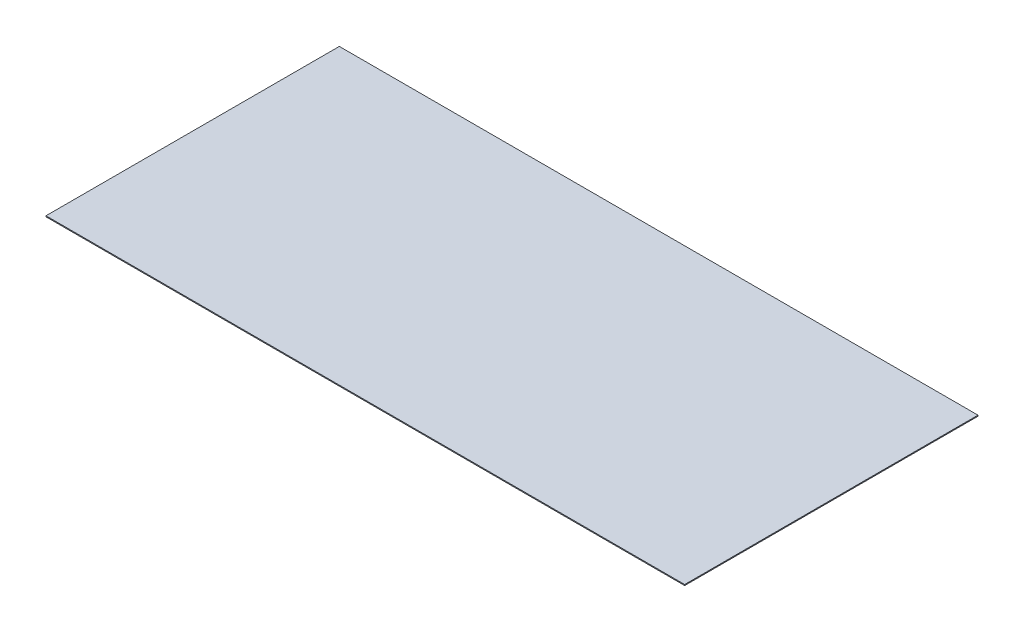
ISO-10303-21;
HEADER;
FILE_DESCRIPTION(('STEP AP214'),'2;1');
FILE_NAME('part.step','',(''),(''),'','','');
FILE_SCHEMA(('AUTOMOTIVE_DESIGN { 1 0 10303 214 1 1 1 1 }'));
ENDSEC;
DATA;
#1=APPLICATION_CONTEXT('core data for automotive mechanical design processes');
#2=APPLICATION_PROTOCOL_DEFINITION('international standard','automotive_design',2000,#1);
#3=PRODUCT_CONTEXT('',#1,'mechanical');
#4=PRODUCT('Part','Part','',(#3));
#5=PRODUCT_RELATED_PRODUCT_CATEGORY('part','',(#4));
#6=PRODUCT_DEFINITION_FORMATION('','',#4);
#7=PRODUCT_DEFINITION_CONTEXT('part definition',#1,'design');
#8=PRODUCT_DEFINITION('design','',#6,#7);
#9=PRODUCT_DEFINITION_SHAPE('','',#8);
#10=(LENGTH_UNIT() NAMED_UNIT(*) SI_UNIT(.MILLI.,.METRE.));
#11=(NAMED_UNIT(*) PLANE_ANGLE_UNIT() SI_UNIT($,.RADIAN.));
#12=(NAMED_UNIT(*) SI_UNIT($,.STERADIAN.) SOLID_ANGLE_UNIT());
#13=UNCERTAINTY_MEASURE_WITH_UNIT(LENGTH_MEASURE(1.E-05),#10,'distance_accuracy_value','');
#14=(GEOMETRIC_REPRESENTATION_CONTEXT(3) GLOBAL_UNCERTAINTY_ASSIGNED_CONTEXT((#13)) GLOBAL_UNIT_ASSIGNED_CONTEXT((#10,
#11,#12)) REPRESENTATION_CONTEXT('',''));
#15=CARTESIAN_POINT('',(0.,0.,0.));
#16=DIRECTION('',(0.,0.,1.));
#17=DIRECTION('',(1.,0.,0.));
#18=AXIS2_PLACEMENT_3D('',#15,#16,#17);
#19=CARTESIAN_POINT('',(337.5,1.,-155.));
#20=DIRECTION('',(-1.,0.,0.));
#21=DIRECTION('',(0.,0.,1.));
#22=AXIS2_PLACEMENT_3D('',#19,#20,#21);
#23=PLANE('',#22);
#24=DIRECTION('',(0.,0.,-1.));
#25=VECTOR('',#24,1.);
#26=CARTESIAN_POINT('',(337.5,0.,-155.));
#27=LINE('',#26,#25);
#28=CARTESIAN_POINT('',(337.5,0.,155.));
#29=VERTEX_POINT('',#28);
#30=CARTESIAN_POINT('',(337.5,0.,-155.));
#31=VERTEX_POINT('',#30);
#32=EDGE_CURVE('E96',#29,#31,#27,.T.);
#33=ORIENTED_EDGE('',*,*,#32,.T.);
#34=DIRECTION('',(0.,-1.,0.));
#35=VECTOR('',#34,1.);
#36=CARTESIAN_POINT('',(337.5,1.,-155.));
#37=LINE('',#36,#35);
#38=CARTESIAN_POINT('',(337.5,1.,-155.));
#39=VERTEX_POINT('',#38);
#40=EDGE_CURVE('E11',#39,#31,#37,.T.);
#41=ORIENTED_EDGE('',*,*,#40,.F.);
#42=DIRECTION('',(0.,0.,-1.));
#43=VECTOR('',#42,1.);
#44=CARTESIAN_POINT('',(337.5,1.,-155.));
#45=LINE('',#44,#43);
#46=CARTESIAN_POINT('',(337.5,1.,155.));
#47=VERTEX_POINT('',#46);
#48=EDGE_CURVE('E84',#47,#39,#45,.T.);
#49=ORIENTED_EDGE('',*,*,#48,.F.);
#50=DIRECTION('',(0.,-1.,0.));
#51=VECTOR('',#50,1.);
#52=CARTESIAN_POINT('',(337.5,1.,155.));
#53=LINE('',#52,#51);
#54=EDGE_CURVE('E92',#47,#29,#53,.T.);
#55=ORIENTED_EDGE('',*,*,#54,.T.);
#56=EDGE_LOOP('',(#33,#41,#49,#55));
#57=FACE_BOUND('',#56,.T.);
#58=ADVANCED_FACE('F33',(#57),#23,.F.);
#59=CARTESIAN_POINT('',(-337.5,1.,-155.));
#60=DIRECTION('',(0.,0.,1.));
#61=DIRECTION('',(1.,0.,0.));
#62=AXIS2_PLACEMENT_3D('',#59,#60,#61);
#63=PLANE('',#62);
#64=DIRECTION('',(-1.,0.,0.));
#65=VECTOR('',#64,1.);
#66=CARTESIAN_POINT('',(-337.5,0.,-155.));
#67=LINE('',#66,#65);
#68=CARTESIAN_POINT('',(-337.5,0.,-155.));
#69=VERTEX_POINT('',#68);
#70=EDGE_CURVE('E88',#31,#69,#67,.T.);
#71=ORIENTED_EDGE('',*,*,#70,.T.);
#72=DIRECTION('',(0.,-1.,0.));
#73=VECTOR('',#72,1.);
#74=CARTESIAN_POINT('',(-337.5,1.,-155.));
#75=LINE('',#74,#73);
#76=CARTESIAN_POINT('',(-337.5,1.,-155.));
#77=VERTEX_POINT('',#76);
#78=EDGE_CURVE('E41',#77,#69,#75,.T.);
#79=ORIENTED_EDGE('',*,*,#78,.F.);
#80=DIRECTION('',(-1.,0.,0.));
#81=VECTOR('',#80,1.);
#82=CARTESIAN_POINT('',(-337.5,1.,-155.));
#83=LINE('',#82,#81);
#84=EDGE_CURVE('E79',#39,#77,#83,.T.);
#85=ORIENTED_EDGE('',*,*,#84,.F.);
#86=ORIENTED_EDGE('',*,*,#40,.T.);
#87=EDGE_LOOP('',(#71,#79,#85,#86));
#88=FACE_BOUND('',#87,.T.);
#89=ADVANCED_FACE('F87',(#88),#63,.F.);
#90=CARTESIAN_POINT('',(-337.5,1.,-155.));
#91=DIRECTION('',(1.,0.,0.));
#92=DIRECTION('',(0.,0.,-1.));
#93=AXIS2_PLACEMENT_3D('',#90,#91,#92);
#94=PLANE('',#93);
#95=DIRECTION('',(0.,0.,1.));
#96=VECTOR('',#95,1.);
#97=CARTESIAN_POINT('',(-337.5,0.,-155.));
#98=LINE('',#97,#96);
#99=CARTESIAN_POINT('',(-337.5,0.,155.));
#100=VERTEX_POINT('',#99);
#101=EDGE_CURVE('E66',#69,#100,#98,.T.);
#102=ORIENTED_EDGE('',*,*,#101,.T.);
#103=DIRECTION('',(0.,-1.,0.));
#104=VECTOR('',#103,1.);
#105=CARTESIAN_POINT('',(-337.5,1.,155.));
#106=LINE('',#105,#104);
#107=CARTESIAN_POINT('',(-337.5,1.,155.));
#108=VERTEX_POINT('',#107);
#109=EDGE_CURVE('E89',#108,#100,#106,.T.);
#110=ORIENTED_EDGE('',*,*,#109,.F.);
#111=DIRECTION('',(0.,0.,1.));
#112=VECTOR('',#111,1.);
#113=CARTESIAN_POINT('',(-337.5,1.,-155.));
#114=LINE('',#113,#112);
#115=EDGE_CURVE('E82',#77,#108,#114,.T.);
#116=ORIENTED_EDGE('',*,*,#115,.F.);
#117=ORIENTED_EDGE('',*,*,#78,.T.);
#118=EDGE_LOOP('',(#102,#110,#116,#117));
#119=FACE_BOUND('',#118,.T.);
#120=ADVANCED_FACE('F90',(#119),#94,.F.);
#121=CARTESIAN_POINT('',(-337.5,1.,155.));
#122=DIRECTION('',(0.,0.,-1.));
#123=DIRECTION('',(-1.,0.,0.));
#124=AXIS2_PLACEMENT_3D('',#121,#122,#123);
#125=PLANE('',#124);
#126=DIRECTION('',(1.,0.,0.));
#127=VECTOR('',#126,1.);
#128=CARTESIAN_POINT('',(-337.5,0.,155.));
#129=LINE('',#128,#127);
#130=EDGE_CURVE('E72',#100,#29,#129,.T.);
#131=ORIENTED_EDGE('',*,*,#130,.T.);
#132=ORIENTED_EDGE('',*,*,#54,.F.);
#133=DIRECTION('',(1.,0.,0.));
#134=VECTOR('',#133,1.);
#135=CARTESIAN_POINT('',(-337.5,1.,155.));
#136=LINE('',#135,#134);
#137=EDGE_CURVE('E49',#108,#47,#136,.T.);
#138=ORIENTED_EDGE('',*,*,#137,.F.);
#139=ORIENTED_EDGE('',*,*,#109,.T.);
#140=EDGE_LOOP('',(#131,#132,#138,#139));
#141=FACE_BOUND('',#140,.T.);
#142=ADVANCED_FACE('F103',(#141),#125,.F.);
#143=CARTESIAN_POINT('',(0.,1.,0.));
#144=DIRECTION('',(0.,1.,0.));
#145=DIRECTION('',(0.,0.,1.));
#146=AXIS2_PLACEMENT_3D('',#143,#144,#145);
#147=PLANE('',#146);
#148=ORIENTED_EDGE('',*,*,#48,.T.);
#149=ORIENTED_EDGE('',*,*,#84,.T.);
#150=ORIENTED_EDGE('',*,*,#115,.T.);
#151=ORIENTED_EDGE('',*,*,#137,.T.);
#152=EDGE_LOOP('',(#148,#149,#150,#151));
#153=FACE_BOUND('',#152,.T.);
#154=ADVANCED_FACE('F80',(#153),#147,.T.);
#155=CARTESIAN_POINT('',(0.,0.,0.));
#156=DIRECTION('',(0.,1.,0.));
#157=DIRECTION('',(0.,0.,1.));
#158=AXIS2_PLACEMENT_3D('',#155,#156,#157);
#159=PLANE('',#158);
#160=ORIENTED_EDGE('',*,*,#32,.F.);
#161=ORIENTED_EDGE('',*,*,#130,.F.);
#162=ORIENTED_EDGE('',*,*,#101,.F.);
#163=ORIENTED_EDGE('',*,*,#70,.F.);
#164=EDGE_LOOP('',(#160,#161,#162,#163));
#165=FACE_BOUND('',#164,.T.);
#166=ADVANCED_FACE('F106',(#165),#159,.F.);
#167=CLOSED_SHELL('',(#58,#89,#120,#142,#154,#166));
#168=MANIFOLD_SOLID_BREP('B2',#167);
#169=ADVANCED_BREP_SHAPE_REPRESENTATION('',(#18,#168),#14);
#170=SHAPE_DEFINITION_REPRESENTATION(#9,#169);
ENDSEC;
END-ISO-10303-21;
